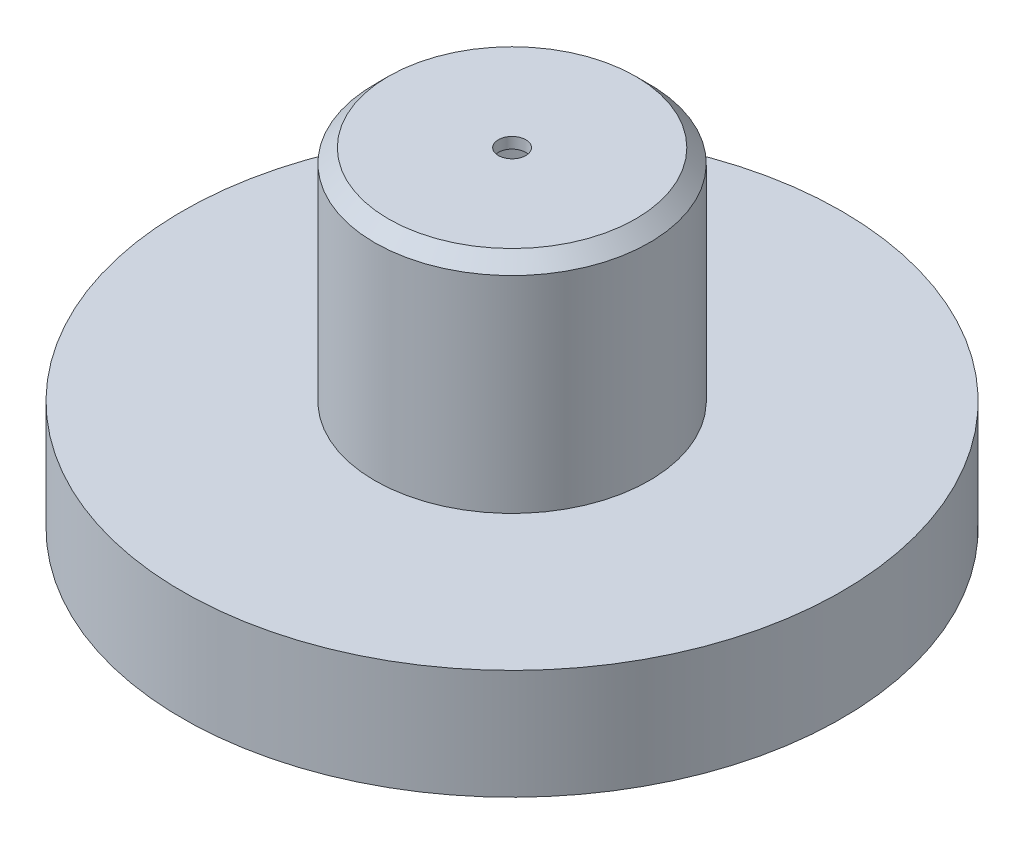
ISO-10303-21;
HEADER;
FILE_DESCRIPTION(('STEP AP214'),'2;1');
FILE_NAME('part.step','',(''),(''),'','','');
FILE_SCHEMA(('AUTOMOTIVE_DESIGN { 1 0 10303 214 1 1 1 1 }'));
ENDSEC;
DATA;
#1=APPLICATION_CONTEXT('core data for automotive mechanical design processes');
#2=APPLICATION_PROTOCOL_DEFINITION('international standard','automotive_design',2000,#1);
#3=PRODUCT_CONTEXT('',#1,'mechanical');
#4=PRODUCT('Part','Part','',(#3));
#5=PRODUCT_RELATED_PRODUCT_CATEGORY('part','',(#4));
#6=PRODUCT_DEFINITION_FORMATION('','',#4);
#7=PRODUCT_DEFINITION_CONTEXT('part definition',#1,'design');
#8=PRODUCT_DEFINITION('design','',#6,#7);
#9=PRODUCT_DEFINITION_SHAPE('','',#8);
#10=(LENGTH_UNIT() NAMED_UNIT(*) SI_UNIT(.MILLI.,.METRE.));
#11=(NAMED_UNIT(*) PLANE_ANGLE_UNIT() SI_UNIT($,.RADIAN.));
#12=(NAMED_UNIT(*) SI_UNIT($,.STERADIAN.) SOLID_ANGLE_UNIT());
#13=UNCERTAINTY_MEASURE_WITH_UNIT(LENGTH_MEASURE(1.E-05),#10,'distance_accuracy_value','');
#14=(GEOMETRIC_REPRESENTATION_CONTEXT(3) GLOBAL_UNCERTAINTY_ASSIGNED_CONTEXT((#13)) GLOBAL_UNIT_ASSIGNED_CONTEXT((#10,
#11,#12)) REPRESENTATION_CONTEXT('',''));
#15=CARTESIAN_POINT('',(0.,0.,0.));
#16=DIRECTION('',(0.,0.,1.));
#17=DIRECTION('',(1.,0.,0.));
#18=AXIS2_PLACEMENT_3D('',#15,#16,#17);
#19=CARTESIAN_POINT('',(0.,130.,0.));
#20=DIRECTION('',(0.,-1.,0.));
#21=DIRECTION('',(0.,0.,-1.));
#22=AXIS2_PLACEMENT_3D('',#19,#20,#21);
#23=CYLINDRICAL_SURFACE('',#22,50.);
#24=CARTESIAN_POINT('',(0.,125.,0.));
#25=DIRECTION('',(0.,1.,0.));
#26=DIRECTION('',(0.,0.,1.));
#27=AXIS2_PLACEMENT_3D('',#24,#25,#26);
#28=CIRCLE('',#27,50.);
#29=CARTESIAN_POINT('',(0.,125.,50.));
#30=VERTEX_POINT('',#29);
#31=EDGE_CURVE('E10',#30,#30,#28,.F.);
#32=ORIENTED_EDGE('',*,*,#31,.T.);
#33=EDGE_LOOP('',(#32));
#34=FACE_BOUND('',#33,.T.);
#35=CARTESIAN_POINT('',(0.,50.,0.));
#36=DIRECTION('',(0.,1.,0.));
#37=DIRECTION('',(0.,0.,1.));
#38=AXIS2_PLACEMENT_3D('',#35,#36,#37);
#39=CIRCLE('',#38,50.);
#40=CARTESIAN_POINT('',(0.,50.,50.));
#41=VERTEX_POINT('',#40);
#42=EDGE_CURVE('E45',#41,#41,#39,.T.);
#43=ORIENTED_EDGE('',*,*,#42,.T.);
#44=EDGE_LOOP('',(#43));
#45=FACE_BOUND('',#44,.T.);
#46=ADVANCED_FACE('F33',(#34,#45),#23,.T.);
#47=CARTESIAN_POINT('',(0.,130.,0.));
#48=DIRECTION('',(0.,1.,0.));
#49=DIRECTION('',(0.,0.,1.));
#50=AXIS2_PLACEMENT_3D('',#47,#48,#49);
#51=PLANE('',#50);
#52=CARTESIAN_POINT('',(0.,130.,0.));
#53=DIRECTION('',(0.,1.,0.));
#54=DIRECTION('',(0.,0.,1.));
#55=AXIS2_PLACEMENT_3D('',#52,#53,#54);
#56=CIRCLE('',#55,5.);
#57=CARTESIAN_POINT('',(0.,130.,5.));
#58=VERTEX_POINT('',#57);
#59=EDGE_CURVE('E71',#58,#58,#56,.T.);
#60=ORIENTED_EDGE('',*,*,#59,.F.);
#61=EDGE_LOOP('',(#60));
#62=FACE_BOUND('',#61,.T.);
#63=CARTESIAN_POINT('',(0.,130.,0.));
#64=DIRECTION('',(0.,1.,0.));
#65=DIRECTION('',(0.,0.,1.));
#66=AXIS2_PLACEMENT_3D('',#63,#64,#65);
#67=CIRCLE('',#66,45.);
#68=CARTESIAN_POINT('',(0.,130.,45.));
#69=VERTEX_POINT('',#68);
#70=EDGE_CURVE('E41',#69,#69,#67,.T.);
#71=ORIENTED_EDGE('',*,*,#70,.T.);
#72=EDGE_LOOP('',(#71));
#73=FACE_BOUND('',#72,.T.);
#74=ADVANCED_FACE('F93',(#62,#73),#51,.T.);
#75=CARTESIAN_POINT('',(0.,130.,0.));
#76=DIRECTION('',(0.,-1.,0.));
#77=DIRECTION('',(0.,0.,-1.));
#78=AXIS2_PLACEMENT_3D('',#75,#76,#77);
#79=CONICAL_SURFACE('',#78,45.,0.785398163397447);
#80=ORIENTED_EDGE('',*,*,#31,.F.);
#81=EDGE_LOOP('',(#80));
#82=FACE_BOUND('',#81,.T.);
#83=ORIENTED_EDGE('',*,*,#70,.F.);
#84=EDGE_LOOP('',(#83));
#85=FACE_BOUND('',#84,.T.);
#86=ADVANCED_FACE('F35',(#82,#85),#79,.T.);
#87=CARTESIAN_POINT('',(0.,10.,0.));
#88=DIRECTION('',(0.,1.,0.));
#89=DIRECTION('',(0.,0.,1.));
#90=AXIS2_PLACEMENT_3D('',#87,#88,#89);
#91=CYLINDRICAL_SURFACE('',#90,120.);
#92=CARTESIAN_POINT('',(0.,10.,0.));
#93=DIRECTION('',(0.,-1.,0.));
#94=DIRECTION('',(0.,0.,-1.));
#95=AXIS2_PLACEMENT_3D('',#92,#93,#94);
#96=CIRCLE('',#95,120.);
#97=CARTESIAN_POINT('',(0.,10.,-120.));
#98=VERTEX_POINT('',#97);
#99=EDGE_CURVE('E50',#98,#98,#96,.T.);
#100=ORIENTED_EDGE('',*,*,#99,.F.);
#101=EDGE_LOOP('',(#100));
#102=FACE_BOUND('',#101,.T.);
#103=CARTESIAN_POINT('',(0.,50.,0.));
#104=DIRECTION('',(0.,-1.,0.));
#105=DIRECTION('',(0.,0.,-1.));
#106=AXIS2_PLACEMENT_3D('',#103,#104,#105);
#107=CIRCLE('',#106,120.);
#108=CARTESIAN_POINT('',(0.,50.,-120.));
#109=VERTEX_POINT('',#108);
#110=EDGE_CURVE('E51',#109,#109,#107,.T.);
#111=ORIENTED_EDGE('',*,*,#110,.T.);
#112=EDGE_LOOP('',(#111));
#113=FACE_BOUND('',#112,.T.);
#114=ADVANCED_FACE('F101',(#102,#113),#91,.T.);
#115=CARTESIAN_POINT('',(0.,10.,0.));
#116=DIRECTION('',(0.,-1.,0.));
#117=DIRECTION('',(0.,0.,-1.));
#118=AXIS2_PLACEMENT_3D('',#115,#116,#117);
#119=PLANE('',#118);
#120=CARTESIAN_POINT('',(0.,10.,0.));
#121=DIRECTION('',(0.,-1.,0.));
#122=DIRECTION('',(0.,0.,-1.));
#123=AXIS2_PLACEMENT_3D('',#120,#121,#122);
#124=CIRCLE('',#123,116.);
#125=CARTESIAN_POINT('',(0.,10.,-116.));
#126=VERTEX_POINT('',#125);
#127=EDGE_CURVE('E57',#126,#126,#124,.T.);
#128=ORIENTED_EDGE('',*,*,#127,.F.);
#129=EDGE_LOOP('',(#128));
#130=FACE_BOUND('',#129,.T.);
#131=ORIENTED_EDGE('',*,*,#99,.T.);
#132=EDGE_LOOP('',(#131));
#133=FACE_BOUND('',#132,.T.);
#134=ADVANCED_FACE('F104',(#130,#133),#119,.T.);
#135=CARTESIAN_POINT('',(0.,50.,0.));
#136=DIRECTION('',(0.,-1.,0.));
#137=DIRECTION('',(0.,0.,-1.));
#138=AXIS2_PLACEMENT_3D('',#135,#136,#137);
#139=PLANE('',#138);
#140=ORIENTED_EDGE('',*,*,#42,.F.);
#141=EDGE_LOOP('',(#140));
#142=FACE_BOUND('',#141,.T.);
#143=ORIENTED_EDGE('',*,*,#110,.F.);
#144=EDGE_LOOP('',(#143));
#145=FACE_BOUND('',#144,.T.);
#146=ADVANCED_FACE('F106',(#142,#145),#139,.F.);
#147=CARTESIAN_POINT('',(0.,130.,0.));
#148=DIRECTION('',(0.,-1.,0.));
#149=DIRECTION('',(0.,0.,-1.));
#150=AXIS2_PLACEMENT_3D('',#147,#148,#149);
#151=CYLINDRICAL_SURFACE('',#150,46.);
#152=CARTESIAN_POINT('',(0.,123.343145750508,0.));
#153=DIRECTION('',(0.,-1.,0.));
#154=DIRECTION('',(0.,0.,-1.));
#155=AXIS2_PLACEMENT_3D('',#152,#153,#154);
#156=CIRCLE('',#155,46.);
#157=CARTESIAN_POINT('',(0.,123.343145750508,-46.));
#158=VERTEX_POINT('',#157);
#159=EDGE_CURVE('E54',#158,#158,#156,.T.);
#160=ORIENTED_EDGE('',*,*,#159,.F.);
#161=EDGE_LOOP('',(#160));
#162=FACE_BOUND('',#161,.T.);
#163=CARTESIAN_POINT('',(0.,46.,0.));
#164=DIRECTION('',(0.,-1.,0.));
#165=DIRECTION('',(0.,0.,-1.));
#166=AXIS2_PLACEMENT_3D('',#163,#164,#165);
#167=CIRCLE('',#166,46.);
#168=CARTESIAN_POINT('',(0.,46.,-46.));
#169=VERTEX_POINT('',#168);
#170=EDGE_CURVE('E60',#169,#169,#167,.F.);
#171=ORIENTED_EDGE('',*,*,#170,.F.);
#172=EDGE_LOOP('',(#171));
#173=FACE_BOUND('',#172,.T.);
#174=ADVANCED_FACE('F109',(#162,#173),#151,.F.);
#175=CARTESIAN_POINT('',(0.,126.,0.));
#176=DIRECTION('',(0.,1.,0.));
#177=DIRECTION('',(0.,0.,1.));
#178=AXIS2_PLACEMENT_3D('',#175,#176,#177);
#179=PLANE('',#178);
#180=CARTESIAN_POINT('',(0.,126.,0.));
#181=DIRECTION('',(0.,1.,0.));
#182=DIRECTION('',(0.,0.,1.));
#183=AXIS2_PLACEMENT_3D('',#180,#181,#182);
#184=CIRCLE('',#183,5.);
#185=CARTESIAN_POINT('',(0.,126.,5.));
#186=VERTEX_POINT('',#185);
#187=EDGE_CURVE('E37',#186,#186,#184,.T.);
#188=ORIENTED_EDGE('',*,*,#187,.T.);
#189=EDGE_LOOP('',(#188));
#190=FACE_BOUND('',#189,.T.);
#191=CARTESIAN_POINT('',(0.,126.,0.));
#192=DIRECTION('',(0.,1.,0.));
#193=DIRECTION('',(0.,0.,1.));
#194=AXIS2_PLACEMENT_3D('',#191,#192,#193);
#195=CIRCLE('',#194,43.3431457505076);
#196=CARTESIAN_POINT('',(0.,126.,43.3431457505076));
#197=VERTEX_POINT('',#196);
#198=EDGE_CURVE('E64',#197,#197,#195,.T.);
#199=ORIENTED_EDGE('',*,*,#198,.F.);
#200=EDGE_LOOP('',(#199));
#201=FACE_BOUND('',#200,.T.);
#202=ADVANCED_FACE('F78',(#190,#201),#179,.F.);
#203=CARTESIAN_POINT('',(0.,127.171572875254,0.));
#204=DIRECTION('',(0.,-1.,0.));
#205=DIRECTION('',(0.,0.,-1.));
#206=AXIS2_PLACEMENT_3D('',#203,#204,#205);
#207=CONICAL_SURFACE('',#206,42.1715728752538,0.785398163397447);
#208=ORIENTED_EDGE('',*,*,#159,.T.);
#209=EDGE_LOOP('',(#208));
#210=FACE_BOUND('',#209,.T.);
#211=ORIENTED_EDGE('',*,*,#198,.T.);
#212=EDGE_LOOP('',(#211));
#213=FACE_BOUND('',#212,.T.);
#214=ADVANCED_FACE('F116',(#210,#213),#207,.F.);
#215=CARTESIAN_POINT('',(0.,10.,0.));
#216=DIRECTION('',(0.,1.,0.));
#217=DIRECTION('',(0.,0.,1.));
#218=AXIS2_PLACEMENT_3D('',#215,#216,#217);
#219=CYLINDRICAL_SURFACE('',#218,116.);
#220=ORIENTED_EDGE('',*,*,#127,.T.);
#221=EDGE_LOOP('',(#220));
#222=FACE_BOUND('',#221,.T.);
#223=CARTESIAN_POINT('',(0.,46.,0.));
#224=DIRECTION('',(0.,-1.,0.));
#225=DIRECTION('',(0.,0.,-1.));
#226=AXIS2_PLACEMENT_3D('',#223,#224,#225);
#227=CIRCLE('',#226,116.);
#228=CARTESIAN_POINT('',(0.,46.,-116.));
#229=VERTEX_POINT('',#228);
#230=EDGE_CURVE('E61',#229,#229,#227,.T.);
#231=ORIENTED_EDGE('',*,*,#230,.F.);
#232=EDGE_LOOP('',(#231));
#233=FACE_BOUND('',#232,.T.);
#234=ADVANCED_FACE('F88',(#222,#233),#219,.F.);
#235=CARTESIAN_POINT('',(0.,46.,0.));
#236=DIRECTION('',(0.,-1.,0.));
#237=DIRECTION('',(0.,0.,-1.));
#238=AXIS2_PLACEMENT_3D('',#235,#236,#237);
#239=PLANE('',#238);
#240=ORIENTED_EDGE('',*,*,#170,.T.);
#241=EDGE_LOOP('',(#240));
#242=FACE_BOUND('',#241,.T.);
#243=ORIENTED_EDGE('',*,*,#230,.T.);
#244=EDGE_LOOP('',(#243));
#245=FACE_BOUND('',#244,.T.);
#246=ADVANCED_FACE('F83',(#242,#245),#239,.T.);
#247=CARTESIAN_POINT('',(0.,-79.,0.));
#248=DIRECTION('',(0.,1.,0.));
#249=DIRECTION('',(0.,0.,1.));
#250=AXIS2_PLACEMENT_3D('',#247,#248,#249);
#251=CYLINDRICAL_SURFACE('',#250,5.);
#252=CARTESIAN_POINT('',(0.,130.,5.));
#253=CARTESIAN_POINT('',(0.,129.958333333333,5.));
#254=CARTESIAN_POINT('',(0.,129.916666666667,5.));
#255=CARTESIAN_POINT('',(0.,129.833333333333,5.));
#256=CARTESIAN_POINT('',(0.,129.791666666667,5.));
#257=CARTESIAN_POINT('',(0.,129.708333333333,5.));
#258=CARTESIAN_POINT('',(0.,129.666666666667,5.));
#259=CARTESIAN_POINT('',(0.,129.583333333333,5.));
#260=CARTESIAN_POINT('',(0.,129.541666666667,5.));
#261=CARTESIAN_POINT('',(0.,129.458333333333,5.));
#262=CARTESIAN_POINT('',(0.,129.416666666667,5.));
#263=CARTESIAN_POINT('',(0.,129.333333333333,5.));
#264=CARTESIAN_POINT('',(0.,129.291666666667,5.));
#265=CARTESIAN_POINT('',(0.,129.208333333333,5.));
#266=CARTESIAN_POINT('',(0.,129.166666666667,5.));
#267=CARTESIAN_POINT('',(0.,129.083333333333,5.));
#268=CARTESIAN_POINT('',(0.,129.041666666667,5.));
#269=CARTESIAN_POINT('',(0.,128.958333333333,5.));
#270=CARTESIAN_POINT('',(0.,128.916666666667,5.));
#271=CARTESIAN_POINT('',(0.,128.833333333333,5.));
#272=CARTESIAN_POINT('',(0.,128.791666666667,5.));
#273=CARTESIAN_POINT('',(0.,128.708333333333,5.));
#274=CARTESIAN_POINT('',(0.,128.666666666667,5.));
#275=CARTESIAN_POINT('',(0.,128.583333333333,5.));
#276=CARTESIAN_POINT('',(0.,128.541666666667,5.));
#277=CARTESIAN_POINT('',(0.,128.458333333333,5.));
#278=CARTESIAN_POINT('',(0.,128.416666666667,5.));
#279=CARTESIAN_POINT('',(0.,128.333333333333,5.));
#280=CARTESIAN_POINT('',(0.,128.291666666667,5.));
#281=CARTESIAN_POINT('',(0.,128.208333333333,5.));
#282=CARTESIAN_POINT('',(0.,128.166666666667,5.));
#283=CARTESIAN_POINT('',(0.,128.083333333333,5.));
#284=CARTESIAN_POINT('',(0.,128.041666666667,5.));
#285=CARTESIAN_POINT('',(0.,127.958333333333,5.));
#286=CARTESIAN_POINT('',(0.,127.916666666667,5.));
#287=CARTESIAN_POINT('',(0.,127.833333333333,5.));
#288=CARTESIAN_POINT('',(0.,127.791666666667,5.));
#289=CARTESIAN_POINT('',(0.,127.708333333333,5.));
#290=CARTESIAN_POINT('',(0.,127.666666666667,5.));
#291=CARTESIAN_POINT('',(0.,127.583333333333,5.));
#292=CARTESIAN_POINT('',(0.,127.541666666667,5.));
#293=CARTESIAN_POINT('',(0.,127.458333333333,5.));
#294=CARTESIAN_POINT('',(0.,127.416666666667,5.));
#295=CARTESIAN_POINT('',(0.,127.333333333333,5.));
#296=CARTESIAN_POINT('',(0.,127.291666666667,5.));
#297=CARTESIAN_POINT('',(0.,127.208333333333,5.));
#298=CARTESIAN_POINT('',(0.,127.166666666667,5.));
#299=CARTESIAN_POINT('',(0.,127.083333333333,5.));
#300=CARTESIAN_POINT('',(0.,127.041666666667,5.));
#301=CARTESIAN_POINT('',(0.,126.958333333333,5.));
#302=CARTESIAN_POINT('',(0.,126.916666666667,5.));
#303=CARTESIAN_POINT('',(0.,126.833333333333,5.));
#304=CARTESIAN_POINT('',(0.,126.791666666667,5.));
#305=CARTESIAN_POINT('',(0.,126.708333333333,5.));
#306=CARTESIAN_POINT('',(0.,126.666666666667,5.));
#307=CARTESIAN_POINT('',(0.,126.583333333333,5.));
#308=CARTESIAN_POINT('',(0.,126.541666666667,5.));
#309=CARTESIAN_POINT('',(0.,126.458333333333,5.));
#310=CARTESIAN_POINT('',(0.,126.416666666667,5.));
#311=CARTESIAN_POINT('',(0.,126.333333333333,5.));
#312=CARTESIAN_POINT('',(0.,126.291666666667,5.));
#313=CARTESIAN_POINT('',(0.,126.208333333333,5.));
#314=CARTESIAN_POINT('',(0.,126.166666666667,5.));
#315=CARTESIAN_POINT('',(0.,126.083333333333,5.));
#316=CARTESIAN_POINT('',(0.,126.041666666667,5.));
#317=CARTESIAN_POINT('',(0.,126.,5.));
#318=B_SPLINE_CURVE_WITH_KNOTS('',3,(#252,#253,#254,#255,#256,#257,#258,#259,#260,#261,#262,
#263,#264,#265,#266,#267,#268,#269,#270,#271,#272,#273,#274,#275,#276,#277,#278,#279,#280,#281,
#282,#283,#284,#285,#286,#287,#288,#289,#290,#291,#292,#293,#294,#295,#296,#297,#298,#299,#300,
#301,#302,#303,#304,#305,#306,#307,#308,#309,#310,#311,#312,#313,#314,#315,#316,#317),
.UNSPECIFIED.,.F.,.F.,(4,2,2,2,2,2,2,2,2,2,2,2,2,2,2,2,2,2,2,2,2,2,2,2,2,2,2,2,2,2,2,2,4),(0.,
0.124999999999986,0.25,0.375000000000014,0.5,0.624999999999987,0.750000000000001,
0.875000000000015,1.,1.12499999999999,1.25,1.37500000000002,1.5,1.62499999999999,1.75,
1.87500000000002,2.,2.12499999999999,2.25,2.37500000000002,2.5,2.62499999999999,2.75,
2.87500000000002,3.,3.12499999999999,3.25,3.37500000000002,3.5,3.62499999999999,3.75,
3.87500000000002,4.),.UNSPECIFIED.);
#319=EDGE_CURVE('BSEAM81',#58,#186,#318,.T.);
#320=ORIENTED_EDGE('',*,*,#59,.T.);
#321=ORIENTED_EDGE('',*,*,#187,.F.);
#322=ORIENTED_EDGE('',*,*,#319,.T.);
#323=ORIENTED_EDGE('',*,*,#319,.F.);
#324=EDGE_LOOP('',(#320,#322,#321,#323));
#325=FACE_BOUND('',#324,.T.);
#326=ADVANCED_FACE('F81',(#325),#251,.F.);
#327=CLOSED_SHELL('',(#46,#74,#86,#114,#134,#146,#174,#202,#214,#234,#246,#326));
#328=MANIFOLD_SOLID_BREP('B2',#327);
#329=ADVANCED_BREP_SHAPE_REPRESENTATION('',(#18,#328),#14);
#330=SHAPE_DEFINITION_REPRESENTATION(#9,#329);
ENDSEC;
END-ISO-10303-21;
